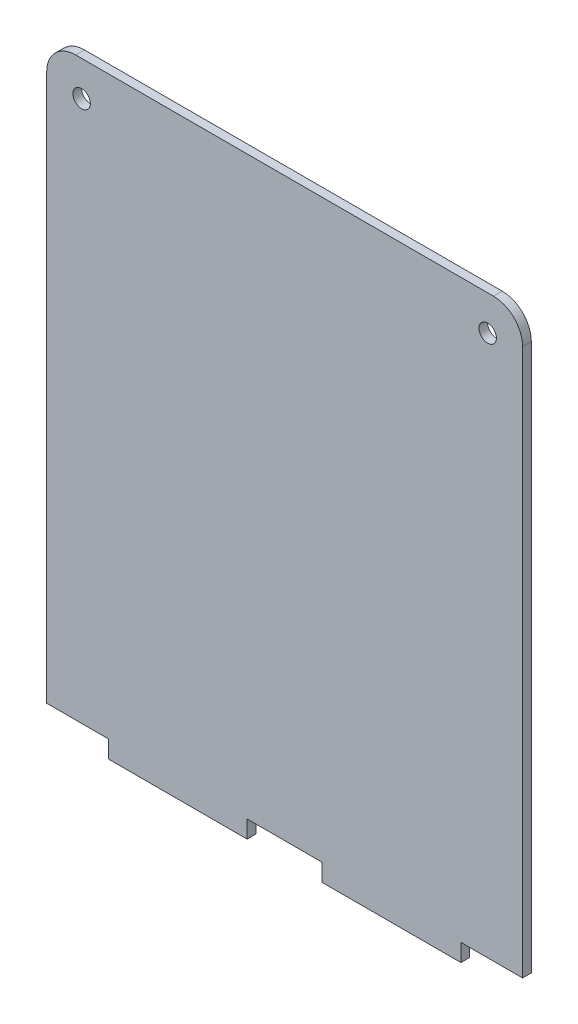
ISO-10303-21;
HEADER;
FILE_DESCRIPTION(('STEP AP214'),'2;1');
FILE_NAME('part.step','',(''),(''),'','','');
FILE_SCHEMA(('AUTOMOTIVE_DESIGN { 1 0 10303 214 1 1 1 1 }'));
ENDSEC;
DATA;
#1=APPLICATION_CONTEXT('core data for automotive mechanical design processes');
#2=APPLICATION_PROTOCOL_DEFINITION('international standard','automotive_design',2000,#1);
#3=PRODUCT_CONTEXT('',#1,'mechanical');
#4=PRODUCT('Part','Part','',(#3));
#5=PRODUCT_RELATED_PRODUCT_CATEGORY('part','',(#4));
#6=PRODUCT_DEFINITION_FORMATION('','',#4);
#7=PRODUCT_DEFINITION_CONTEXT('part definition',#1,'design');
#8=PRODUCT_DEFINITION('design','',#6,#7);
#9=PRODUCT_DEFINITION_SHAPE('','',#8);
#10=(LENGTH_UNIT() NAMED_UNIT(*) SI_UNIT(.MILLI.,.METRE.));
#11=(NAMED_UNIT(*) PLANE_ANGLE_UNIT() SI_UNIT($,.RADIAN.));
#12=(NAMED_UNIT(*) SI_UNIT($,.STERADIAN.) SOLID_ANGLE_UNIT());
#13=UNCERTAINTY_MEASURE_WITH_UNIT(LENGTH_MEASURE(1.E-05),#10,'distance_accuracy_value','');
#14=(GEOMETRIC_REPRESENTATION_CONTEXT(3) GLOBAL_UNCERTAINTY_ASSIGNED_CONTEXT((#13)) GLOBAL_UNIT_ASSIGNED_CONTEXT((#10,
#11,#12)) REPRESENTATION_CONTEXT('',''));
#15=CARTESIAN_POINT('',(0.,0.,0.));
#16=DIRECTION('',(0.,0.,1.));
#17=DIRECTION('',(1.,0.,0.));
#18=AXIS2_PLACEMENT_3D('',#15,#16,#17);
#19=CARTESIAN_POINT('',(0.,0.,1.5));
#20=DIRECTION('',(0.,0.,-1.));
#21=DIRECTION('',(-1.,0.,0.));
#22=AXIS2_PLACEMENT_3D('',#19,#20,#21);
#23=PLANE('',#22);
#24=CARTESIAN_POINT('',(75.8,96.,1.5));
#25=DIRECTION('',(0.,0.,-1.));
#26=DIRECTION('',(-1.,0.,0.));
#27=AXIS2_PLACEMENT_3D('',#24,#25,#26);
#28=CIRCLE('',#27,1.5);
#29=CARTESIAN_POINT('',(74.3,96.,1.5));
#30=VERTEX_POINT('',#29);
#31=EDGE_CURVE('E329',#30,#30,#28,.T.);
#32=ORIENTED_EDGE('',*,*,#31,.T.);
#33=EDGE_LOOP('',(#32));
#34=FACE_BOUND('',#33,.T.);
#35=CARTESIAN_POINT('',(6.,96.,1.5));
#36=DIRECTION('',(0.,0.,1.));
#37=DIRECTION('',(1.,0.,0.));
#38=AXIS2_PLACEMENT_3D('',#35,#36,#37);
#39=CIRCLE('',#38,1.5);
#40=CARTESIAN_POINT('',(7.5,96.,1.5));
#41=VERTEX_POINT('',#40);
#42=EDGE_CURVE('E156',#41,#41,#39,.T.);
#43=ORIENTED_EDGE('',*,*,#42,.F.);
#44=EDGE_LOOP('',(#43));
#45=FACE_BOUND('',#44,.T.);
#46=DIRECTION('',(0.,1.,0.));
#47=VECTOR('',#46,1.);
#48=CARTESIAN_POINT('',(81.8,0.,1.5));
#49=LINE('',#48,#47);
#50=CARTESIAN_POINT('',(81.8,3.,1.5));
#51=VERTEX_POINT('',#50);
#52=CARTESIAN_POINT('',(81.8,97.,1.5));
#53=VERTEX_POINT('',#52);
#54=EDGE_CURVE('E166',#51,#53,#49,.T.);
#55=ORIENTED_EDGE('',*,*,#54,.T.);
#56=CARTESIAN_POINT('',(76.8,97.,1.5));
#57=DIRECTION('',(0.,0.,-1.));
#58=DIRECTION('',(-1.,0.,0.));
#59=AXIS2_PLACEMENT_3D('',#56,#57,#58);
#60=CIRCLE('',#59,5.);
#61=CARTESIAN_POINT('',(76.8,102.,1.5));
#62=VERTEX_POINT('',#61);
#63=EDGE_CURVE('E40',#53,#62,#60,.F.);
#64=ORIENTED_EDGE('',*,*,#63,.T.);
#65=DIRECTION('',(-1.,0.,0.));
#66=VECTOR('',#65,1.);
#67=CARTESIAN_POINT('',(0.,102.,1.5));
#68=LINE('',#67,#66);
#69=CARTESIAN_POINT('',(5.,102.,1.5));
#70=VERTEX_POINT('',#69);
#71=EDGE_CURVE('E172',#62,#70,#68,.T.);
#72=ORIENTED_EDGE('',*,*,#71,.T.);
#73=CARTESIAN_POINT('',(5.,97.,1.5));
#74=DIRECTION('',(0.,0.,-1.));
#75=DIRECTION('',(-1.,0.,0.));
#76=AXIS2_PLACEMENT_3D('',#73,#74,#75);
#77=CIRCLE('',#76,5.);
#78=CARTESIAN_POINT('',(0.,97.,1.5));
#79=VERTEX_POINT('',#78);
#80=EDGE_CURVE('E47',#70,#79,#77,.F.);
#81=ORIENTED_EDGE('',*,*,#80,.T.);
#82=DIRECTION('',(0.,-1.,0.));
#83=VECTOR('',#82,1.);
#84=CARTESIAN_POINT('',(0.,0.,1.5));
#85=LINE('',#84,#83);
#86=CARTESIAN_POINT('',(0.,3.,1.5));
#87=VERTEX_POINT('',#86);
#88=EDGE_CURVE('E163',#79,#87,#85,.T.);
#89=ORIENTED_EDGE('',*,*,#88,.T.);
#90=DIRECTION('',(1.,0.,0.));
#91=VECTOR('',#90,1.);
#92=CARTESIAN_POINT('',(0.,3.,1.5));
#93=LINE('',#92,#91);
#94=CARTESIAN_POINT('',(10.6,3.,1.5));
#95=VERTEX_POINT('',#94);
#96=EDGE_CURVE('E248',#87,#95,#93,.T.);
#97=ORIENTED_EDGE('',*,*,#96,.T.);
#98=DIRECTION('',(0.,1.,0.));
#99=VECTOR('',#98,1.);
#100=CARTESIAN_POINT('',(10.6,0.,1.5));
#101=LINE('',#100,#99);
#102=CARTESIAN_POINT('',(10.6,0.,1.5));
#103=VERTEX_POINT('',#102);
#104=EDGE_CURVE('E238',#103,#95,#101,.T.);
#105=ORIENTED_EDGE('',*,*,#104,.F.);
#106=DIRECTION('',(1.,0.,0.));
#107=VECTOR('',#106,1.);
#108=CARTESIAN_POINT('',(0.,0.,1.5));
#109=LINE('',#108,#107);
#110=CARTESIAN_POINT('',(34.455,0.,1.5));
#111=VERTEX_POINT('',#110);
#112=EDGE_CURVE('E162',#103,#111,#109,.T.);
#113=ORIENTED_EDGE('',*,*,#112,.T.);
#114=DIRECTION('',(0.,1.,0.));
#115=VECTOR('',#114,1.);
#116=CARTESIAN_POINT('',(34.455,0.,1.5));
#117=LINE('',#116,#115);
#118=CARTESIAN_POINT('',(34.455,3.,1.5));
#119=VERTEX_POINT('',#118);
#120=EDGE_CURVE('E231',#111,#119,#117,.T.);
#121=ORIENTED_EDGE('',*,*,#120,.T.);
#122=DIRECTION('',(1.,0.,0.));
#123=VECTOR('',#122,1.);
#124=CARTESIAN_POINT('',(0.,3.,1.5));
#125=LINE('',#124,#123);
#126=CARTESIAN_POINT('',(47.345,3.,1.5));
#127=VERTEX_POINT('',#126);
#128=EDGE_CURVE('E234',#119,#127,#125,.T.);
#129=ORIENTED_EDGE('',*,*,#128,.T.);
#130=DIRECTION('',(0.,1.,0.));
#131=VECTOR('',#130,1.);
#132=CARTESIAN_POINT('',(47.345,0.,1.5));
#133=LINE('',#132,#131);
#134=CARTESIAN_POINT('',(47.345,0.,1.5));
#135=VERTEX_POINT('',#134);
#136=EDGE_CURVE('E161',#135,#127,#133,.T.);
#137=ORIENTED_EDGE('',*,*,#136,.F.);
#138=CARTESIAN_POINT('',(71.2,0.,1.5));
#139=VERTEX_POINT('',#138);
#140=EDGE_CURVE('E153',#135,#139,#109,.T.);
#141=ORIENTED_EDGE('',*,*,#140,.T.);
#142=DIRECTION('',(0.,1.,0.));
#143=VECTOR('',#142,1.);
#144=CARTESIAN_POINT('',(71.2,0.,1.5));
#145=LINE('',#144,#143);
#146=CARTESIAN_POINT('',(71.2,3.,1.5));
#147=VERTEX_POINT('',#146);
#148=EDGE_CURVE('E135',#139,#147,#145,.T.);
#149=ORIENTED_EDGE('',*,*,#148,.T.);
#150=DIRECTION('',(-1.,0.,0.));
#151=VECTOR('',#150,1.);
#152=CARTESIAN_POINT('',(0.,3.,1.5));
#153=LINE('',#152,#151);
#154=EDGE_CURVE('E145',#51,#147,#153,.T.);
#155=ORIENTED_EDGE('',*,*,#154,.F.);
#156=EDGE_LOOP('',(#55,#64,#72,#81,#89,#97,#105,#113,#121,#129,#137,#141,#149,#155));
#157=FACE_BOUND('',#156,.T.);
#158=ADVANCED_FACE('F32',(#34,#45,#157),#23,.F.);
#159=CARTESIAN_POINT('',(0.,0.,0.));
#160=DIRECTION('',(0.,0.,-1.));
#161=DIRECTION('',(-1.,0.,0.));
#162=AXIS2_PLACEMENT_3D('',#159,#160,#161);
#163=PLANE('',#162);
#164=CARTESIAN_POINT('',(75.8,96.,0.));
#165=DIRECTION('',(0.,0.,-1.));
#166=DIRECTION('',(-1.,0.,0.));
#167=AXIS2_PLACEMENT_3D('',#164,#165,#166);
#168=CIRCLE('',#167,1.5);
#169=CARTESIAN_POINT('',(74.3,96.,0.));
#170=VERTEX_POINT('',#169);
#171=EDGE_CURVE('E327',#170,#170,#168,.T.);
#172=ORIENTED_EDGE('',*,*,#171,.F.);
#173=EDGE_LOOP('',(#172));
#174=FACE_BOUND('',#173,.T.);
#175=CARTESIAN_POINT('',(6.,96.,0.));
#176=DIRECTION('',(0.,0.,1.));
#177=DIRECTION('',(1.,0.,0.));
#178=AXIS2_PLACEMENT_3D('',#175,#176,#177);
#179=CIRCLE('',#178,1.5);
#180=CARTESIAN_POINT('',(7.5,96.,0.));
#181=VERTEX_POINT('',#180);
#182=EDGE_CURVE('E216',#181,#181,#179,.T.);
#183=ORIENTED_EDGE('',*,*,#182,.T.);
#184=EDGE_LOOP('',(#183));
#185=FACE_BOUND('',#184,.T.);
#186=DIRECTION('',(-1.,0.,0.));
#187=VECTOR('',#186,1.);
#188=CARTESIAN_POINT('',(0.,102.,0.));
#189=LINE('',#188,#187);
#190=CARTESIAN_POINT('',(76.8,102.,0.));
#191=VERTEX_POINT('',#190);
#192=CARTESIAN_POINT('',(5.,102.,0.));
#193=VERTEX_POINT('',#192);
#194=EDGE_CURVE('E167',#191,#193,#189,.T.);
#195=ORIENTED_EDGE('',*,*,#194,.F.);
#196=CARTESIAN_POINT('',(76.8,97.,0.));
#197=DIRECTION('',(0.,0.,-1.));
#198=DIRECTION('',(-1.,0.,0.));
#199=AXIS2_PLACEMENT_3D('',#196,#197,#198);
#200=CIRCLE('',#199,5.);
#201=CARTESIAN_POINT('',(81.8,97.,0.));
#202=VERTEX_POINT('',#201);
#203=EDGE_CURVE('E191',#191,#202,#200,.T.);
#204=ORIENTED_EDGE('',*,*,#203,.T.);
#205=DIRECTION('',(0.,1.,0.));
#206=VECTOR('',#205,1.);
#207=CARTESIAN_POINT('',(81.8,0.,0.));
#208=LINE('',#207,#206);
#209=CARTESIAN_POINT('',(81.8,3.,0.));
#210=VERTEX_POINT('',#209);
#211=EDGE_CURVE('E181',#210,#202,#208,.T.);
#212=ORIENTED_EDGE('',*,*,#211,.F.);
#213=DIRECTION('',(-1.,0.,0.));
#214=VECTOR('',#213,1.);
#215=CARTESIAN_POINT('',(0.,3.,0.));
#216=LINE('',#215,#214);
#217=CARTESIAN_POINT('',(71.2,3.,0.));
#218=VERTEX_POINT('',#217);
#219=EDGE_CURVE('E146',#210,#218,#216,.T.);
#220=ORIENTED_EDGE('',*,*,#219,.T.);
#221=DIRECTION('',(0.,1.,0.));
#222=VECTOR('',#221,1.);
#223=CARTESIAN_POINT('',(71.2,0.,0.));
#224=LINE('',#223,#222);
#225=CARTESIAN_POINT('',(71.2,0.,0.));
#226=VERTEX_POINT('',#225);
#227=EDGE_CURVE('E211',#226,#218,#224,.T.);
#228=ORIENTED_EDGE('',*,*,#227,.F.);
#229=DIRECTION('',(1.,0.,0.));
#230=VECTOR('',#229,1.);
#231=CARTESIAN_POINT('',(0.,0.,0.));
#232=LINE('',#231,#230);
#233=CARTESIAN_POINT('',(47.345,0.,0.));
#234=VERTEX_POINT('',#233);
#235=EDGE_CURVE('E155',#234,#226,#232,.T.);
#236=ORIENTED_EDGE('',*,*,#235,.F.);
#237=DIRECTION('',(0.,1.,0.));
#238=VECTOR('',#237,1.);
#239=CARTESIAN_POINT('',(47.345,0.,0.));
#240=LINE('',#239,#238);
#241=CARTESIAN_POINT('',(47.345,3.,0.));
#242=VERTEX_POINT('',#241);
#243=EDGE_CURVE('E235',#234,#242,#240,.T.);
#244=ORIENTED_EDGE('',*,*,#243,.T.);
#245=DIRECTION('',(1.,0.,0.));
#246=VECTOR('',#245,1.);
#247=CARTESIAN_POINT('',(0.,3.,0.));
#248=LINE('',#247,#246);
#249=CARTESIAN_POINT('',(34.455,3.,0.));
#250=VERTEX_POINT('',#249);
#251=EDGE_CURVE('E240',#250,#242,#248,.T.);
#252=ORIENTED_EDGE('',*,*,#251,.F.);
#253=DIRECTION('',(0.,1.,0.));
#254=VECTOR('',#253,1.);
#255=CARTESIAN_POINT('',(34.455,0.,0.));
#256=LINE('',#255,#254);
#257=CARTESIAN_POINT('',(34.455,0.,0.));
#258=VERTEX_POINT('',#257);
#259=EDGE_CURVE('E224',#258,#250,#256,.T.);
#260=ORIENTED_EDGE('',*,*,#259,.F.);
#261=CARTESIAN_POINT('',(10.6,0.,0.));
#262=VERTEX_POINT('',#261);
#263=EDGE_CURVE('E178',#262,#258,#232,.T.);
#264=ORIENTED_EDGE('',*,*,#263,.F.);
#265=DIRECTION('',(0.,1.,0.));
#266=VECTOR('',#265,1.);
#267=CARTESIAN_POINT('',(10.6,0.,0.));
#268=LINE('',#267,#266);
#269=CARTESIAN_POINT('',(10.6,3.,0.));
#270=VERTEX_POINT('',#269);
#271=EDGE_CURVE('E244',#262,#270,#268,.T.);
#272=ORIENTED_EDGE('',*,*,#271,.T.);
#273=DIRECTION('',(1.,0.,0.));
#274=VECTOR('',#273,1.);
#275=CARTESIAN_POINT('',(0.,3.,0.));
#276=LINE('',#275,#274);
#277=CARTESIAN_POINT('',(0.,3.,0.));
#278=VERTEX_POINT('',#277);
#279=EDGE_CURVE('E247',#278,#270,#276,.T.);
#280=ORIENTED_EDGE('',*,*,#279,.F.);
#281=DIRECTION('',(0.,-1.,0.));
#282=VECTOR('',#281,1.);
#283=CARTESIAN_POINT('',(0.,0.,0.));
#284=LINE('',#283,#282);
#285=CARTESIAN_POINT('',(0.,97.,0.));
#286=VERTEX_POINT('',#285);
#287=EDGE_CURVE('E175',#286,#278,#284,.T.);
#288=ORIENTED_EDGE('',*,*,#287,.F.);
#289=CARTESIAN_POINT('',(5.,97.,0.));
#290=DIRECTION('',(0.,0.,-1.));
#291=DIRECTION('',(-1.,0.,0.));
#292=AXIS2_PLACEMENT_3D('',#289,#290,#291);
#293=CIRCLE('',#292,5.);
#294=EDGE_CURVE('E189',#286,#193,#293,.T.);
#295=ORIENTED_EDGE('',*,*,#294,.T.);
#296=EDGE_LOOP('',(#195,#204,#212,#220,#228,#236,#244,#252,#260,#264,#272,#280,#288,#295));
#297=FACE_BOUND('',#296,.T.);
#298=ADVANCED_FACE('F205',(#174,#185,#297),#163,.T.);
#299=CARTESIAN_POINT('',(0.,0.,1.5));
#300=DIRECTION('',(0.,1.,0.));
#301=DIRECTION('',(0.,0.,1.));
#302=AXIS2_PLACEMENT_3D('',#299,#300,#301);
#303=PLANE('',#302);
#304=DIRECTION('',(0.,0.,1.));
#305=VECTOR('',#304,1.);
#306=CARTESIAN_POINT('',(71.2,0.,0.));
#307=LINE('',#306,#305);
#308=EDGE_CURVE('E138',#226,#139,#307,.T.);
#309=ORIENTED_EDGE('',*,*,#308,.T.);
#310=ORIENTED_EDGE('',*,*,#140,.F.);
#311=DIRECTION('',(0.,0.,1.));
#312=VECTOR('',#311,1.);
#313=CARTESIAN_POINT('',(47.345,0.,0.));
#314=LINE('',#313,#312);
#315=EDGE_CURVE('E222',#234,#135,#314,.T.);
#316=ORIENTED_EDGE('',*,*,#315,.F.);
#317=ORIENTED_EDGE('',*,*,#235,.T.);
#318=EDGE_LOOP('',(#309,#310,#316,#317));
#319=FACE_BOUND('',#318,.T.);
#320=ADVANCED_FACE('F151',(#319),#303,.F.);
#321=DIRECTION('',(0.,0.,1.));
#322=VECTOR('',#321,1.);
#323=CARTESIAN_POINT('',(34.455,0.,0.));
#324=LINE('',#323,#322);
#325=EDGE_CURVE('E219',#258,#111,#324,.T.);
#326=ORIENTED_EDGE('',*,*,#325,.T.);
#327=ORIENTED_EDGE('',*,*,#112,.F.);
#328=DIRECTION('',(0.,0.,1.));
#329=VECTOR('',#328,1.);
#330=CARTESIAN_POINT('',(10.6,0.,0.));
#331=LINE('',#330,#329);
#332=EDGE_CURVE('E251',#262,#103,#331,.T.);
#333=ORIENTED_EDGE('',*,*,#332,.F.);
#334=ORIENTED_EDGE('',*,*,#263,.T.);
#335=EDGE_LOOP('',(#326,#327,#333,#334));
#336=FACE_BOUND('',#335,.T.);
#337=ADVANCED_FACE('F267',(#336),#303,.F.);
#338=CARTESIAN_POINT('',(0.,0.,1.5));
#339=DIRECTION('',(1.,0.,0.));
#340=DIRECTION('',(0.,0.,-1.));
#341=AXIS2_PLACEMENT_3D('',#338,#339,#340);
#342=PLANE('',#341);
#343=ORIENTED_EDGE('',*,*,#88,.F.);
#344=DIRECTION('',(0.,0.,-1.));
#345=VECTOR('',#344,1.);
#346=CARTESIAN_POINT('',(0.,97.,1.5));
#347=LINE('',#346,#345);
#348=EDGE_CURVE('E11',#79,#286,#347,.T.);
#349=ORIENTED_EDGE('',*,*,#348,.T.);
#350=ORIENTED_EDGE('',*,*,#287,.T.);
#351=DIRECTION('',(0.,0.,1.));
#352=VECTOR('',#351,1.);
#353=CARTESIAN_POINT('',(0.,3.,0.));
#354=LINE('',#353,#352);
#355=EDGE_CURVE('E177',#278,#87,#354,.T.);
#356=ORIENTED_EDGE('',*,*,#355,.T.);
#357=EDGE_LOOP('',(#343,#349,#350,#356));
#358=FACE_BOUND('',#357,.T.);
#359=ADVANCED_FACE('F309',(#358),#342,.F.);
#360=CARTESIAN_POINT('',(81.8,0.,1.5));
#361=DIRECTION('',(-1.,0.,0.));
#362=DIRECTION('',(0.,0.,1.));
#363=AXIS2_PLACEMENT_3D('',#360,#361,#362);
#364=PLANE('',#363);
#365=ORIENTED_EDGE('',*,*,#211,.T.);
#366=DIRECTION('',(0.,0.,-1.));
#367=VECTOR('',#366,1.);
#368=CARTESIAN_POINT('',(81.8,97.,1.5));
#369=LINE('',#368,#367);
#370=EDGE_CURVE('E55',#202,#53,#369,.F.);
#371=ORIENTED_EDGE('',*,*,#370,.T.);
#372=ORIENTED_EDGE('',*,*,#54,.F.);
#373=DIRECTION('',(0.,0.,1.));
#374=VECTOR('',#373,1.);
#375=CARTESIAN_POINT('',(81.8,3.,0.));
#376=LINE('',#375,#374);
#377=EDGE_CURVE('E209',#210,#51,#376,.T.);
#378=ORIENTED_EDGE('',*,*,#377,.F.);
#379=EDGE_LOOP('',(#365,#371,#372,#378));
#380=FACE_BOUND('',#379,.T.);
#381=ADVANCED_FACE('F208',(#380),#364,.F.);
#382=CARTESIAN_POINT('',(0.,102.,1.5));
#383=DIRECTION('',(0.,-1.,0.));
#384=DIRECTION('',(0.,0.,-1.));
#385=AXIS2_PLACEMENT_3D('',#382,#383,#384);
#386=PLANE('',#385);
#387=ORIENTED_EDGE('',*,*,#71,.F.);
#388=DIRECTION('',(0.,0.,-1.));
#389=VECTOR('',#388,1.);
#390=CARTESIAN_POINT('',(76.8,102.,1.5));
#391=LINE('',#390,#389);
#392=EDGE_CURVE('E186',#62,#191,#391,.T.);
#393=ORIENTED_EDGE('',*,*,#392,.T.);
#394=ORIENTED_EDGE('',*,*,#194,.T.);
#395=DIRECTION('',(0.,0.,-1.));
#396=VECTOR('',#395,1.);
#397=CARTESIAN_POINT('',(5.,102.,1.5));
#398=LINE('',#397,#396);
#399=EDGE_CURVE('E174',#193,#70,#398,.F.);
#400=ORIENTED_EDGE('',*,*,#399,.T.);
#401=EDGE_LOOP('',(#387,#393,#394,#400));
#402=FACE_BOUND('',#401,.T.);
#403=ADVANCED_FACE('F199',(#402),#386,.F.);
#404=CARTESIAN_POINT('',(0.,3.,0.));
#405=DIRECTION('',(0.,-1.,0.));
#406=DIRECTION('',(0.,0.,-1.));
#407=AXIS2_PLACEMENT_3D('',#404,#405,#406);
#408=PLANE('',#407);
#409=ORIENTED_EDGE('',*,*,#96,.F.);
#410=ORIENTED_EDGE('',*,*,#355,.F.);
#411=ORIENTED_EDGE('',*,*,#279,.T.);
#412=DIRECTION('',(0.,0.,1.));
#413=VECTOR('',#412,1.);
#414=CARTESIAN_POINT('',(10.6,3.,0.));
#415=LINE('',#414,#413);
#416=EDGE_CURVE('E258',#270,#95,#415,.T.);
#417=ORIENTED_EDGE('',*,*,#416,.T.);
#418=EDGE_LOOP('',(#409,#410,#411,#417));
#419=FACE_BOUND('',#418,.T.);
#420=ADVANCED_FACE('F306',(#419),#408,.T.);
#421=CARTESIAN_POINT('',(10.6,0.,0.));
#422=DIRECTION('',(1.,0.,0.));
#423=DIRECTION('',(0.,0.,-1.));
#424=AXIS2_PLACEMENT_3D('',#421,#422,#423);
#425=PLANE('',#424);
#426=ORIENTED_EDGE('',*,*,#104,.T.);
#427=ORIENTED_EDGE('',*,*,#416,.F.);
#428=ORIENTED_EDGE('',*,*,#271,.F.);
#429=ORIENTED_EDGE('',*,*,#332,.T.);
#430=EDGE_LOOP('',(#426,#427,#428,#429));
#431=FACE_BOUND('',#430,.T.);
#432=ADVANCED_FACE('F262',(#431),#425,.F.);
#433=CARTESIAN_POINT('',(34.455,0.,0.));
#434=DIRECTION('',(1.,0.,0.));
#435=DIRECTION('',(0.,0.,-1.));
#436=AXIS2_PLACEMENT_3D('',#433,#434,#435);
#437=PLANE('',#436);
#438=ORIENTED_EDGE('',*,*,#120,.F.);
#439=ORIENTED_EDGE('',*,*,#325,.F.);
#440=ORIENTED_EDGE('',*,*,#259,.T.);
#441=DIRECTION('',(0.,0.,1.));
#442=VECTOR('',#441,1.);
#443=CARTESIAN_POINT('',(34.455,3.,0.));
#444=LINE('',#443,#442);
#445=EDGE_CURVE('E227',#250,#119,#444,.T.);
#446=ORIENTED_EDGE('',*,*,#445,.T.);
#447=EDGE_LOOP('',(#438,#439,#440,#446));
#448=FACE_BOUND('',#447,.T.);
#449=ADVANCED_FACE('F270',(#448),#437,.T.);
#450=CARTESIAN_POINT('',(0.,3.,0.));
#451=DIRECTION('',(0.,-1.,0.));
#452=DIRECTION('',(0.,0.,-1.));
#453=AXIS2_PLACEMENT_3D('',#450,#451,#452);
#454=PLANE('',#453);
#455=ORIENTED_EDGE('',*,*,#128,.F.);
#456=ORIENTED_EDGE('',*,*,#445,.F.);
#457=ORIENTED_EDGE('',*,*,#251,.T.);
#458=DIRECTION('',(0.,0.,1.));
#459=VECTOR('',#458,1.);
#460=CARTESIAN_POINT('',(47.345,3.,0.));
#461=LINE('',#460,#459);
#462=EDGE_CURVE('E225',#242,#127,#461,.T.);
#463=ORIENTED_EDGE('',*,*,#462,.T.);
#464=EDGE_LOOP('',(#455,#456,#457,#463));
#465=FACE_BOUND('',#464,.T.);
#466=ADVANCED_FACE('F276',(#465),#454,.T.);
#467=CARTESIAN_POINT('',(47.345,0.,0.));
#468=DIRECTION('',(1.,0.,0.));
#469=DIRECTION('',(0.,0.,-1.));
#470=AXIS2_PLACEMENT_3D('',#467,#468,#469);
#471=PLANE('',#470);
#472=ORIENTED_EDGE('',*,*,#136,.T.);
#473=ORIENTED_EDGE('',*,*,#462,.F.);
#474=ORIENTED_EDGE('',*,*,#243,.F.);
#475=ORIENTED_EDGE('',*,*,#315,.T.);
#476=EDGE_LOOP('',(#472,#473,#474,#475));
#477=FACE_BOUND('',#476,.T.);
#478=ADVANCED_FACE('F278',(#477),#471,.F.);
#479=CARTESIAN_POINT('',(71.2,0.,0.));
#480=DIRECTION('',(1.,0.,0.));
#481=DIRECTION('',(0.,0.,-1.));
#482=AXIS2_PLACEMENT_3D('',#479,#480,#481);
#483=PLANE('',#482);
#484=ORIENTED_EDGE('',*,*,#148,.F.);
#485=ORIENTED_EDGE('',*,*,#308,.F.);
#486=ORIENTED_EDGE('',*,*,#227,.T.);
#487=DIRECTION('',(0.,0.,1.));
#488=VECTOR('',#487,1.);
#489=CARTESIAN_POINT('',(71.2,3.,0.));
#490=LINE('',#489,#488);
#491=EDGE_CURVE('E141',#218,#147,#490,.T.);
#492=ORIENTED_EDGE('',*,*,#491,.T.);
#493=EDGE_LOOP('',(#484,#485,#486,#492));
#494=FACE_BOUND('',#493,.T.);
#495=ADVANCED_FACE('F137',(#494),#483,.T.);
#496=CARTESIAN_POINT('',(0.,3.,0.));
#497=DIRECTION('',(0.,1.,0.));
#498=DIRECTION('',(0.,0.,1.));
#499=AXIS2_PLACEMENT_3D('',#496,#497,#498);
#500=PLANE('',#499);
#501=ORIENTED_EDGE('',*,*,#154,.T.);
#502=ORIENTED_EDGE('',*,*,#491,.F.);
#503=ORIENTED_EDGE('',*,*,#219,.F.);
#504=ORIENTED_EDGE('',*,*,#377,.T.);
#505=EDGE_LOOP('',(#501,#502,#503,#504));
#506=FACE_BOUND('',#505,.T.);
#507=ADVANCED_FACE('F279',(#506),#500,.F.);
#508=CARTESIAN_POINT('',(6.,96.,0.));
#509=DIRECTION('',(0.,0.,1.));
#510=DIRECTION('',(1.,0.,0.));
#511=AXIS2_PLACEMENT_3D('',#508,#509,#510);
#512=CYLINDRICAL_SURFACE('',#511,1.5);
#513=ORIENTED_EDGE('',*,*,#182,.F.);
#514=EDGE_LOOP('',(#513));
#515=FACE_BOUND('',#514,.T.);
#516=ORIENTED_EDGE('',*,*,#42,.T.);
#517=EDGE_LOOP('',(#516));
#518=FACE_BOUND('',#517,.T.);
#519=ADVANCED_FACE('F281',(#515,#518),#512,.F.);
#520=CARTESIAN_POINT('',(75.8,96.,0.));
#521=DIRECTION('',(0.,0.,1.));
#522=DIRECTION('',(1.,0.,0.));
#523=AXIS2_PLACEMENT_3D('',#520,#521,#522);
#524=CYLINDRICAL_SURFACE('',#523,1.5);
#525=ORIENTED_EDGE('',*,*,#171,.T.);
#526=EDGE_LOOP('',(#525));
#527=FACE_BOUND('',#526,.T.);
#528=ORIENTED_EDGE('',*,*,#31,.F.);
#529=EDGE_LOOP('',(#528));
#530=FACE_BOUND('',#529,.T.);
#531=ADVANCED_FACE('F287',(#527,#530),#524,.F.);
#532=CARTESIAN_POINT('',(76.8,97.,1.5));
#533=DIRECTION('',(0.,0.,-1.));
#534=DIRECTION('',(-1.,0.,0.));
#535=AXIS2_PLACEMENT_3D('',#532,#533,#534);
#536=CYLINDRICAL_SURFACE('',#535,5.);
#537=ORIENTED_EDGE('',*,*,#63,.F.);
#538=ORIENTED_EDGE('',*,*,#370,.F.);
#539=ORIENTED_EDGE('',*,*,#203,.F.);
#540=ORIENTED_EDGE('',*,*,#392,.F.);
#541=EDGE_LOOP('',(#537,#538,#539,#540));
#542=FACE_BOUND('',#541,.T.);
#543=ADVANCED_FACE('F202',(#542),#536,.T.);
#544=CARTESIAN_POINT('',(5.,97.,1.5));
#545=DIRECTION('',(0.,0.,-1.));
#546=DIRECTION('',(-1.,0.,0.));
#547=AXIS2_PLACEMENT_3D('',#544,#545,#546);
#548=CYLINDRICAL_SURFACE('',#547,5.);
#549=ORIENTED_EDGE('',*,*,#80,.F.);
#550=ORIENTED_EDGE('',*,*,#399,.F.);
#551=ORIENTED_EDGE('',*,*,#294,.F.);
#552=ORIENTED_EDGE('',*,*,#348,.F.);
#553=EDGE_LOOP('',(#549,#550,#551,#552));
#554=FACE_BOUND('',#553,.T.);
#555=ADVANCED_FACE('F34',(#554),#548,.T.);
#556=CLOSED_SHELL('',(#158,#298,#320,#337,#359,#381,#403,#420,#432,#449,#466,#478,#495,#507,
#519,#531,#543,#555));
#557=MANIFOLD_SOLID_BREP('B2',#556);
#558=ADVANCED_BREP_SHAPE_REPRESENTATION('',(#18,#557),#14);
#559=SHAPE_DEFINITION_REPRESENTATION(#9,#558);
ENDSEC;
END-ISO-10303-21;
